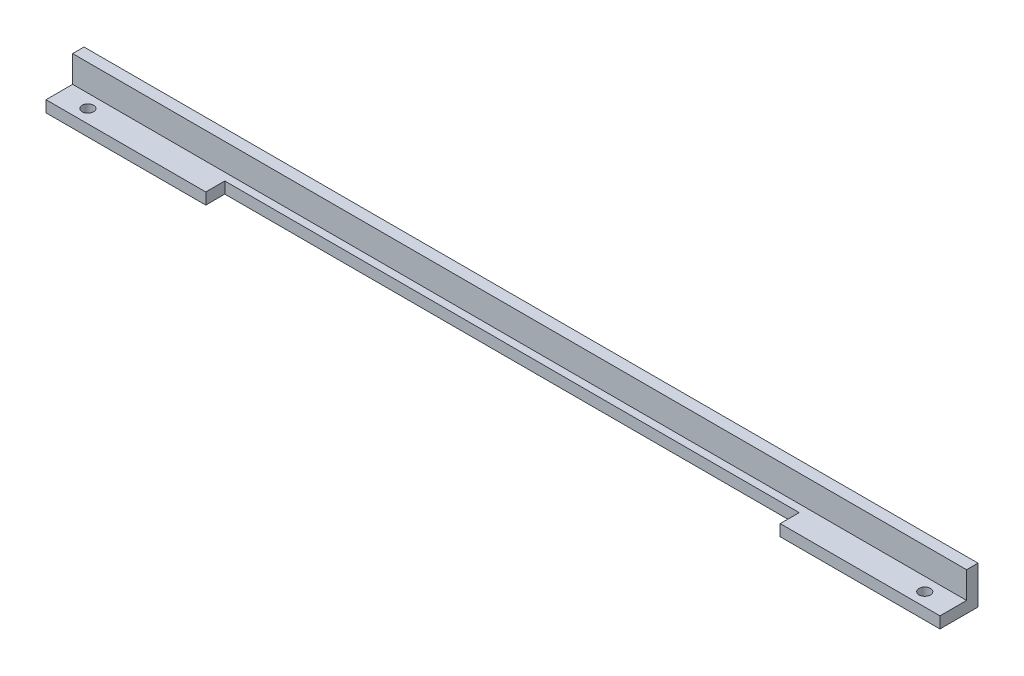
ISO-10303-21;
HEADER;
FILE_DESCRIPTION(('STEP AP214'),'2;1');
FILE_NAME('part.step','',(''),(''),'','','');
FILE_SCHEMA(('AUTOMOTIVE_DESIGN { 1 0 10303 214 1 1 1 1 }'));
ENDSEC;
DATA;
#1=APPLICATION_CONTEXT('core data for automotive mechanical design processes');
#2=APPLICATION_PROTOCOL_DEFINITION('international standard','automotive_design',2000,#1);
#3=PRODUCT_CONTEXT('',#1,'mechanical');
#4=PRODUCT('Part','Part','',(#3));
#5=PRODUCT_RELATED_PRODUCT_CATEGORY('part','',(#4));
#6=PRODUCT_DEFINITION_FORMATION('','',#4);
#7=PRODUCT_DEFINITION_CONTEXT('part definition',#1,'design');
#8=PRODUCT_DEFINITION('design','',#6,#7);
#9=PRODUCT_DEFINITION_SHAPE('','',#8);
#10=(LENGTH_UNIT() NAMED_UNIT(*) SI_UNIT(.MILLI.,.METRE.));
#11=(NAMED_UNIT(*) PLANE_ANGLE_UNIT() SI_UNIT($,.RADIAN.));
#12=(NAMED_UNIT(*) SI_UNIT($,.STERADIAN.) SOLID_ANGLE_UNIT());
#13=UNCERTAINTY_MEASURE_WITH_UNIT(LENGTH_MEASURE(1.E-05),#10,'distance_accuracy_value','');
#14=(GEOMETRIC_REPRESENTATION_CONTEXT(3) GLOBAL_UNCERTAINTY_ASSIGNED_CONTEXT((#13)) GLOBAL_UNIT_ASSIGNED_CONTEXT((#10,
#11,#12)) REPRESENTATION_CONTEXT('',''));
#15=CARTESIAN_POINT('',(0.,0.,0.));
#16=DIRECTION('',(0.,0.,1.));
#17=DIRECTION('',(1.,0.,0.));
#18=AXIS2_PLACEMENT_3D('',#15,#16,#17);
#19=CARTESIAN_POINT('',(235.,0.,10.));
#20=DIRECTION('',(0.,0.,-1.));
#21=DIRECTION('',(-1.,0.,0.));
#22=AXIS2_PLACEMENT_3D('',#19,#20,#21);
#23=PLANE('',#22);
#24=DIRECTION('',(-1.,0.,0.));
#25=VECTOR('',#24,1.);
#26=CARTESIAN_POINT('',(235.,0.,10.));
#27=LINE('',#26,#25);
#28=CARTESIAN_POINT('',(42.,0.,10.));
#29=VERTEX_POINT('',#28);
#30=CARTESIAN_POINT('',(0.,0.,10.));
#31=VERTEX_POINT('',#30);
#32=EDGE_CURVE('E157',#29,#31,#27,.T.);
#33=ORIENTED_EDGE('',*,*,#32,.F.);
#34=DIRECTION('',(0.,-1.,0.));
#35=VECTOR('',#34,1.);
#36=CARTESIAN_POINT('',(42.,0.,10.));
#37=LINE('',#36,#35);
#38=CARTESIAN_POINT('',(42.,3.,10.));
#39=VERTEX_POINT('',#38);
#40=EDGE_CURVE('E191',#39,#29,#37,.T.);
#41=ORIENTED_EDGE('',*,*,#40,.F.);
#42=DIRECTION('',(-1.,0.,0.));
#43=VECTOR('',#42,1.);
#44=CARTESIAN_POINT('',(235.,3.,10.));
#45=LINE('',#44,#43);
#46=CARTESIAN_POINT('',(0.,3.,10.));
#47=VERTEX_POINT('',#46);
#48=EDGE_CURVE('E130',#39,#47,#45,.T.);
#49=ORIENTED_EDGE('',*,*,#48,.T.);
#50=DIRECTION('',(0.,-1.,0.));
#51=VECTOR('',#50,1.);
#52=CARTESIAN_POINT('',(0.,0.,10.));
#53=LINE('',#52,#51);
#54=EDGE_CURVE('E151',#47,#31,#53,.T.);
#55=ORIENTED_EDGE('',*,*,#54,.T.);
#56=EDGE_LOOP('',(#33,#41,#49,#55));
#57=FACE_BOUND('',#56,.T.);
#58=ADVANCED_FACE('F35',(#57),#23,.F.);
#59=CARTESIAN_POINT('',(235.,10.,0.));
#60=DIRECTION('',(0.,0.,1.));
#61=DIRECTION('',(0.,-1.,0.));
#62=AXIS2_PLACEMENT_3D('',#59,#60,#61);
#63=PLANE('',#62);
#64=DIRECTION('',(0.,1.,0.));
#65=VECTOR('',#64,1.);
#66=CARTESIAN_POINT('',(0.,10.,0.));
#67=LINE('',#66,#65);
#68=CARTESIAN_POINT('',(0.,0.,0.));
#69=VERTEX_POINT('',#68);
#70=CARTESIAN_POINT('',(0.,10.,0.));
#71=VERTEX_POINT('',#70);
#72=EDGE_CURVE('E140',#69,#71,#67,.T.);
#73=ORIENTED_EDGE('',*,*,#72,.T.);
#74=DIRECTION('',(-1.,0.,0.));
#75=VECTOR('',#74,1.);
#76=CARTESIAN_POINT('',(235.,10.,0.));
#77=LINE('',#76,#75);
#78=CARTESIAN_POINT('',(235.,10.,0.));
#79=VERTEX_POINT('',#78);
#80=EDGE_CURVE('E11',#79,#71,#77,.T.);
#81=ORIENTED_EDGE('',*,*,#80,.F.);
#82=DIRECTION('',(0.,1.,0.));
#83=VECTOR('',#82,1.);
#84=CARTESIAN_POINT('',(235.,10.,0.));
#85=LINE('',#84,#83);
#86=CARTESIAN_POINT('',(235.,0.,0.));
#87=VERTEX_POINT('',#86);
#88=EDGE_CURVE('E155',#87,#79,#85,.T.);
#89=ORIENTED_EDGE('',*,*,#88,.F.);
#90=DIRECTION('',(-1.,0.,0.));
#91=VECTOR('',#90,1.);
#92=CARTESIAN_POINT('',(235.,0.,0.));
#93=LINE('',#92,#91);
#94=EDGE_CURVE('E136',#87,#69,#93,.T.);
#95=ORIENTED_EDGE('',*,*,#94,.T.);
#96=EDGE_LOOP('',(#73,#81,#89,#95));
#97=FACE_BOUND('',#96,.T.);
#98=ADVANCED_FACE('F37',(#97),#63,.F.);
#99=CARTESIAN_POINT('',(235.,10.,3.));
#100=DIRECTION('',(0.,-1.,0.));
#101=DIRECTION('',(0.,0.,-1.));
#102=AXIS2_PLACEMENT_3D('',#99,#100,#101);
#103=PLANE('',#102);
#104=DIRECTION('',(0.,0.,1.));
#105=VECTOR('',#104,1.);
#106=CARTESIAN_POINT('',(0.,10.,3.));
#107=LINE('',#106,#105);
#108=CARTESIAN_POINT('',(0.,10.,3.));
#109=VERTEX_POINT('',#108);
#110=EDGE_CURVE('E143',#71,#109,#107,.T.);
#111=ORIENTED_EDGE('',*,*,#110,.T.);
#112=DIRECTION('',(-1.,0.,0.));
#113=VECTOR('',#112,1.);
#114=CARTESIAN_POINT('',(235.,10.,3.));
#115=LINE('',#114,#113);
#116=CARTESIAN_POINT('',(235.,10.,3.));
#117=VERTEX_POINT('',#116);
#118=EDGE_CURVE('E44',#117,#109,#115,.T.);
#119=ORIENTED_EDGE('',*,*,#118,.F.);
#120=DIRECTION('',(0.,0.,1.));
#121=VECTOR('',#120,1.);
#122=CARTESIAN_POINT('',(235.,10.,3.));
#123=LINE('',#122,#121);
#124=EDGE_CURVE('E95',#79,#117,#123,.T.);
#125=ORIENTED_EDGE('',*,*,#124,.F.);
#126=ORIENTED_EDGE('',*,*,#80,.T.);
#127=EDGE_LOOP('',(#111,#119,#125,#126));
#128=FACE_BOUND('',#127,.T.);
#129=ADVANCED_FACE('F177',(#128),#103,.F.);
#130=CARTESIAN_POINT('',(235.,10.,3.));
#131=DIRECTION('',(0.,0.,-1.));
#132=DIRECTION('',(0.,1.,0.));
#133=AXIS2_PLACEMENT_3D('',#130,#131,#132);
#134=PLANE('',#133);
#135=DIRECTION('',(0.,-1.,0.));
#136=VECTOR('',#135,1.);
#137=CARTESIAN_POINT('',(0.,10.,3.));
#138=LINE('',#137,#136);
#139=CARTESIAN_POINT('',(0.,3.,3.));
#140=VERTEX_POINT('',#139);
#141=EDGE_CURVE('E146',#109,#140,#138,.T.);
#142=ORIENTED_EDGE('',*,*,#141,.T.);
#143=DIRECTION('',(-1.,0.,0.));
#144=VECTOR('',#143,1.);
#145=CARTESIAN_POINT('',(235.,3.,3.));
#146=LINE('',#145,#144);
#147=CARTESIAN_POINT('',(235.,3.,3.));
#148=VERTEX_POINT('',#147);
#149=EDGE_CURVE('E129',#148,#140,#146,.T.);
#150=ORIENTED_EDGE('',*,*,#149,.F.);
#151=DIRECTION('',(0.,-1.,0.));
#152=VECTOR('',#151,1.);
#153=CARTESIAN_POINT('',(235.,10.,3.));
#154=LINE('',#153,#152);
#155=EDGE_CURVE('E112',#117,#148,#154,.T.);
#156=ORIENTED_EDGE('',*,*,#155,.F.);
#157=ORIENTED_EDGE('',*,*,#118,.T.);
#158=EDGE_LOOP('',(#142,#150,#156,#157));
#159=FACE_BOUND('',#158,.T.);
#160=ADVANCED_FACE('F180',(#159),#134,.F.);
#161=CARTESIAN_POINT('',(235.,3.,10.));
#162=DIRECTION('',(0.,-1.,0.));
#163=DIRECTION('',(0.,0.,-1.));
#164=AXIS2_PLACEMENT_3D('',#161,#162,#163);
#165=PLANE('',#164);
#166=ORIENTED_EDGE('',*,*,#48,.F.);
#167=DIRECTION('',(0.,0.,1.));
#168=VECTOR('',#167,1.);
#169=CARTESIAN_POINT('',(42.,3.,5.));
#170=LINE('',#169,#168);
#171=CARTESIAN_POINT('',(42.,3.,5.));
#172=VERTEX_POINT('',#171);
#173=EDGE_CURVE('E194',#172,#39,#170,.T.);
#174=ORIENTED_EDGE('',*,*,#173,.F.);
#175=DIRECTION('',(-1.,0.,0.));
#176=VECTOR('',#175,1.);
#177=CARTESIAN_POINT('',(42.,3.,5.));
#178=LINE('',#177,#176);
#179=CARTESIAN_POINT('',(193.,3.,5.));
#180=VERTEX_POINT('',#179);
#181=EDGE_CURVE('E213',#180,#172,#178,.T.);
#182=ORIENTED_EDGE('',*,*,#181,.F.);
#183=DIRECTION('',(0.,0.,1.));
#184=VECTOR('',#183,1.);
#185=CARTESIAN_POINT('',(193.,3.,5.));
#186=LINE('',#185,#184);
#187=CARTESIAN_POINT('',(193.,3.,10.));
#188=VERTEX_POINT('',#187);
#189=EDGE_CURVE('E126',#180,#188,#186,.T.);
#190=ORIENTED_EDGE('',*,*,#189,.T.);
#191=CARTESIAN_POINT('',(235.,3.,10.));
#192=VERTEX_POINT('',#191);
#193=EDGE_CURVE('E119',#192,#188,#45,.T.);
#194=ORIENTED_EDGE('',*,*,#193,.F.);
#195=DIRECTION('',(0.,0.,1.));
#196=VECTOR('',#195,1.);
#197=CARTESIAN_POINT('',(235.,3.,10.));
#198=LINE('',#197,#196);
#199=EDGE_CURVE('E105',#148,#192,#198,.T.);
#200=ORIENTED_EDGE('',*,*,#199,.F.);
#201=ORIENTED_EDGE('',*,*,#149,.T.);
#202=DIRECTION('',(0.,0.,1.));
#203=VECTOR('',#202,1.);
#204=CARTESIAN_POINT('',(0.,3.,10.));
#205=LINE('',#204,#203);
#206=EDGE_CURVE('E148',#140,#47,#205,.T.);
#207=ORIENTED_EDGE('',*,*,#206,.T.);
#208=EDGE_LOOP('',(#166,#174,#182,#190,#194,#200,#201,#207));
#209=FACE_BOUND('',#208,.T.);
#210=CARTESIAN_POINT('',(227.5,3.,6.5));
#211=DIRECTION('',(0.,1.,0.));
#212=DIRECTION('',(0.,0.,-1.));
#213=AXIS2_PLACEMENT_3D('',#210,#211,#212);
#214=CIRCLE('',#213,1.5);
#215=CARTESIAN_POINT('',(227.5,3.,5.));
#216=VERTEX_POINT('',#215);
#217=EDGE_CURVE('E170',#216,#216,#214,.T.);
#218=ORIENTED_EDGE('',*,*,#217,.F.);
#219=EDGE_LOOP('',(#218));
#220=FACE_BOUND('',#219,.T.);
#221=CARTESIAN_POINT('',(7.5,3.,6.5));
#222=DIRECTION('',(0.,1.,0.));
#223=DIRECTION('',(0.,0.,1.));
#224=AXIS2_PLACEMENT_3D('',#221,#222,#223);
#225=CIRCLE('',#224,1.5);
#226=CARTESIAN_POINT('',(7.5,3.,8.));
#227=VERTEX_POINT('',#226);
#228=EDGE_CURVE('E162',#227,#227,#225,.T.);
#229=ORIENTED_EDGE('',*,*,#228,.F.);
#230=EDGE_LOOP('',(#229));
#231=FACE_BOUND('',#230,.T.);
#232=ADVANCED_FACE('F121',(#209,#220,#231),#165,.F.);
#233=ORIENTED_EDGE('',*,*,#193,.T.);
#234=DIRECTION('',(0.,1.,0.));
#235=VECTOR('',#234,1.);
#236=CARTESIAN_POINT('',(193.,0.,10.));
#237=LINE('',#236,#235);
#238=CARTESIAN_POINT('',(193.,0.,10.));
#239=VERTEX_POINT('',#238);
#240=EDGE_CURVE('E228',#239,#188,#237,.T.);
#241=ORIENTED_EDGE('',*,*,#240,.F.);
#242=CARTESIAN_POINT('',(235.,0.,10.));
#243=VERTEX_POINT('',#242);
#244=EDGE_CURVE('E134',#243,#239,#27,.T.);
#245=ORIENTED_EDGE('',*,*,#244,.F.);
#246=DIRECTION('',(0.,-1.,0.));
#247=VECTOR('',#246,1.);
#248=CARTESIAN_POINT('',(235.,0.,10.));
#249=LINE('',#248,#247);
#250=EDGE_CURVE('E109',#192,#243,#249,.T.);
#251=ORIENTED_EDGE('',*,*,#250,.F.);
#252=EDGE_LOOP('',(#233,#241,#245,#251));
#253=FACE_BOUND('',#252,.T.);
#254=ADVANCED_FACE('F132',(#253),#23,.F.);
#255=CARTESIAN_POINT('',(235.,0.,0.));
#256=DIRECTION('',(0.,1.,0.));
#257=DIRECTION('',(0.,0.,1.));
#258=AXIS2_PLACEMENT_3D('',#255,#256,#257);
#259=PLANE('',#258);
#260=CARTESIAN_POINT('',(227.5,0.,6.5));
#261=DIRECTION('',(0.,1.,0.));
#262=DIRECTION('',(0.,0.,1.));
#263=AXIS2_PLACEMENT_3D('',#260,#261,#262);
#264=CIRCLE('',#263,1.5);
#265=CARTESIAN_POINT('',(227.5,0.,7.99999999999999));
#266=VERTEX_POINT('',#265);
#267=EDGE_CURVE('E39',#266,#266,#264,.T.);
#268=ORIENTED_EDGE('',*,*,#267,.T.);
#269=EDGE_LOOP('',(#268));
#270=FACE_BOUND('',#269,.T.);
#271=CARTESIAN_POINT('',(7.5,0.,6.5));
#272=DIRECTION('',(0.,1.,0.));
#273=DIRECTION('',(0.,0.,1.));
#274=AXIS2_PLACEMENT_3D('',#271,#272,#273);
#275=CIRCLE('',#274,1.5);
#276=CARTESIAN_POINT('',(7.5,0.,8.));
#277=VERTEX_POINT('',#276);
#278=EDGE_CURVE('E144',#277,#277,#275,.T.);
#279=ORIENTED_EDGE('',*,*,#278,.T.);
#280=EDGE_LOOP('',(#279));
#281=FACE_BOUND('',#280,.T.);
#282=DIRECTION('',(1.,0.,0.));
#283=VECTOR('',#282,1.);
#284=CARTESIAN_POINT('',(193.,0.,5.));
#285=LINE('',#284,#283);
#286=CARTESIAN_POINT('',(42.,0.,5.));
#287=VERTEX_POINT('',#286);
#288=CARTESIAN_POINT('',(193.,0.,5.));
#289=VERTEX_POINT('',#288);
#290=EDGE_CURVE('E214',#287,#289,#285,.T.);
#291=ORIENTED_EDGE('',*,*,#290,.F.);
#292=DIRECTION('',(0.,0.,1.));
#293=VECTOR('',#292,1.);
#294=CARTESIAN_POINT('',(42.,0.,5.));
#295=LINE('',#294,#293);
#296=EDGE_CURVE('E225',#287,#29,#295,.T.);
#297=ORIENTED_EDGE('',*,*,#296,.T.);
#298=ORIENTED_EDGE('',*,*,#32,.T.);
#299=DIRECTION('',(0.,0.,-1.));
#300=VECTOR('',#299,1.);
#301=CARTESIAN_POINT('',(0.,0.,0.));
#302=LINE('',#301,#300);
#303=EDGE_CURVE('E87',#31,#69,#302,.T.);
#304=ORIENTED_EDGE('',*,*,#303,.T.);
#305=ORIENTED_EDGE('',*,*,#94,.F.);
#306=DIRECTION('',(0.,0.,-1.));
#307=VECTOR('',#306,1.);
#308=CARTESIAN_POINT('',(235.,0.,0.));
#309=LINE('',#308,#307);
#310=EDGE_CURVE('E61',#243,#87,#309,.T.);
#311=ORIENTED_EDGE('',*,*,#310,.F.);
#312=ORIENTED_EDGE('',*,*,#244,.T.);
#313=DIRECTION('',(0.,0.,1.));
#314=VECTOR('',#313,1.);
#315=CARTESIAN_POINT('',(193.,0.,5.));
#316=LINE('',#315,#314);
#317=EDGE_CURVE('E212',#289,#239,#316,.T.);
#318=ORIENTED_EDGE('',*,*,#317,.F.);
#319=EDGE_LOOP('',(#291,#297,#298,#304,#305,#311,#312,#318));
#320=FACE_BOUND('',#319,.T.);
#321=ADVANCED_FACE('F220',(#270,#281,#320),#259,.F.);
#322=CARTESIAN_POINT('',(235.,0.,0.));
#323=DIRECTION('',(-1.,0.,0.));
#324=DIRECTION('',(0.,0.,1.));
#325=AXIS2_PLACEMENT_3D('',#322,#323,#324);
#326=PLANE('',#325);
#327=ORIENTED_EDGE('',*,*,#88,.T.);
#328=ORIENTED_EDGE('',*,*,#124,.T.);
#329=ORIENTED_EDGE('',*,*,#155,.T.);
#330=ORIENTED_EDGE('',*,*,#199,.T.);
#331=ORIENTED_EDGE('',*,*,#250,.T.);
#332=ORIENTED_EDGE('',*,*,#310,.T.);
#333=EDGE_LOOP('',(#327,#328,#329,#330,#331,#332));
#334=FACE_BOUND('',#333,.T.);
#335=ADVANCED_FACE('F107',(#334),#326,.F.);
#336=CARTESIAN_POINT('',(0.,0.,0.));
#337=DIRECTION('',(-1.,0.,0.));
#338=DIRECTION('',(0.,0.,1.));
#339=AXIS2_PLACEMENT_3D('',#336,#337,#338);
#340=PLANE('',#339);
#341=ORIENTED_EDGE('',*,*,#72,.F.);
#342=ORIENTED_EDGE('',*,*,#303,.F.);
#343=ORIENTED_EDGE('',*,*,#54,.F.);
#344=ORIENTED_EDGE('',*,*,#206,.F.);
#345=ORIENTED_EDGE('',*,*,#141,.F.);
#346=ORIENTED_EDGE('',*,*,#110,.F.);
#347=EDGE_LOOP('',(#341,#342,#343,#344,#345,#346));
#348=FACE_BOUND('',#347,.T.);
#349=ADVANCED_FACE('F185',(#348),#340,.T.);
#350=CARTESIAN_POINT('',(7.5,-7.,6.5));
#351=DIRECTION('',(0.,1.,0.));
#352=DIRECTION('',(0.,0.,1.));
#353=AXIS2_PLACEMENT_3D('',#350,#351,#352);
#354=CYLINDRICAL_SURFACE('',#353,1.5);
#355=ORIENTED_EDGE('',*,*,#228,.T.);
#356=EDGE_LOOP('',(#355));
#357=FACE_BOUND('',#356,.T.);
#358=ORIENTED_EDGE('',*,*,#278,.F.);
#359=EDGE_LOOP('',(#358));
#360=FACE_BOUND('',#359,.T.);
#361=ADVANCED_FACE('F240',(#357,#360),#354,.F.);
#362=CARTESIAN_POINT('',(227.5,-7.,6.5));
#363=DIRECTION('',(0.,1.,0.));
#364=DIRECTION('',(0.,0.,1.));
#365=AXIS2_PLACEMENT_3D('',#362,#363,#364);
#366=CYLINDRICAL_SURFACE('',#365,1.5);
#367=ORIENTED_EDGE('',*,*,#217,.T.);
#368=EDGE_LOOP('',(#367));
#369=FACE_BOUND('',#368,.T.);
#370=ORIENTED_EDGE('',*,*,#267,.F.);
#371=EDGE_LOOP('',(#370));
#372=FACE_BOUND('',#371,.T.);
#373=ADVANCED_FACE('F232',(#369,#372),#366,.F.);
#374=CARTESIAN_POINT('',(42.,0.,5.));
#375=DIRECTION('',(-1.,0.,0.));
#376=DIRECTION('',(0.,0.,1.));
#377=AXIS2_PLACEMENT_3D('',#374,#375,#376);
#378=PLANE('',#377);
#379=ORIENTED_EDGE('',*,*,#40,.T.);
#380=ORIENTED_EDGE('',*,*,#296,.F.);
#381=DIRECTION('',(0.,-1.,0.));
#382=VECTOR('',#381,1.);
#383=CARTESIAN_POINT('',(42.,0.,5.));
#384=LINE('',#383,#382);
#385=EDGE_CURVE('E52',#172,#287,#384,.T.);
#386=ORIENTED_EDGE('',*,*,#385,.F.);
#387=ORIENTED_EDGE('',*,*,#173,.T.);
#388=EDGE_LOOP('',(#379,#380,#386,#387));
#389=FACE_BOUND('',#388,.T.);
#390=ADVANCED_FACE('F230',(#389),#378,.F.);
#391=CARTESIAN_POINT('',(193.,0.,5.));
#392=DIRECTION('',(1.,0.,0.));
#393=DIRECTION('',(0.,0.,-1.));
#394=AXIS2_PLACEMENT_3D('',#391,#392,#393);
#395=PLANE('',#394);
#396=ORIENTED_EDGE('',*,*,#240,.T.);
#397=ORIENTED_EDGE('',*,*,#189,.F.);
#398=DIRECTION('',(0.,1.,0.));
#399=VECTOR('',#398,1.);
#400=CARTESIAN_POINT('',(193.,0.,5.));
#401=LINE('',#400,#399);
#402=EDGE_CURVE('E209',#289,#180,#401,.T.);
#403=ORIENTED_EDGE('',*,*,#402,.F.);
#404=ORIENTED_EDGE('',*,*,#317,.T.);
#405=EDGE_LOOP('',(#396,#397,#403,#404));
#406=FACE_BOUND('',#405,.T.);
#407=ADVANCED_FACE('F210',(#406),#395,.F.);
#408=CARTESIAN_POINT('',(0.,0.,5.));
#409=DIRECTION('',(0.,0.,-1.));
#410=DIRECTION('',(-1.,0.,0.));
#411=AXIS2_PLACEMENT_3D('',#408,#409,#410);
#412=PLANE('',#411);
#413=ORIENTED_EDGE('',*,*,#290,.T.);
#414=ORIENTED_EDGE('',*,*,#402,.T.);
#415=ORIENTED_EDGE('',*,*,#181,.T.);
#416=ORIENTED_EDGE('',*,*,#385,.T.);
#417=EDGE_LOOP('',(#413,#414,#415,#416));
#418=FACE_BOUND('',#417,.T.);
#419=ADVANCED_FACE('F217',(#418),#412,.F.);
#420=CLOSED_SHELL('',(#58,#98,#129,#160,#232,#254,#321,#335,#349,#361,#373,#390,#407,#419));
#421=MANIFOLD_SOLID_BREP('B2',#420);
#422=ADVANCED_BREP_SHAPE_REPRESENTATION('',(#18,#421),#14);
#423=SHAPE_DEFINITION_REPRESENTATION(#9,#422);
ENDSEC;
END-ISO-10303-21;
